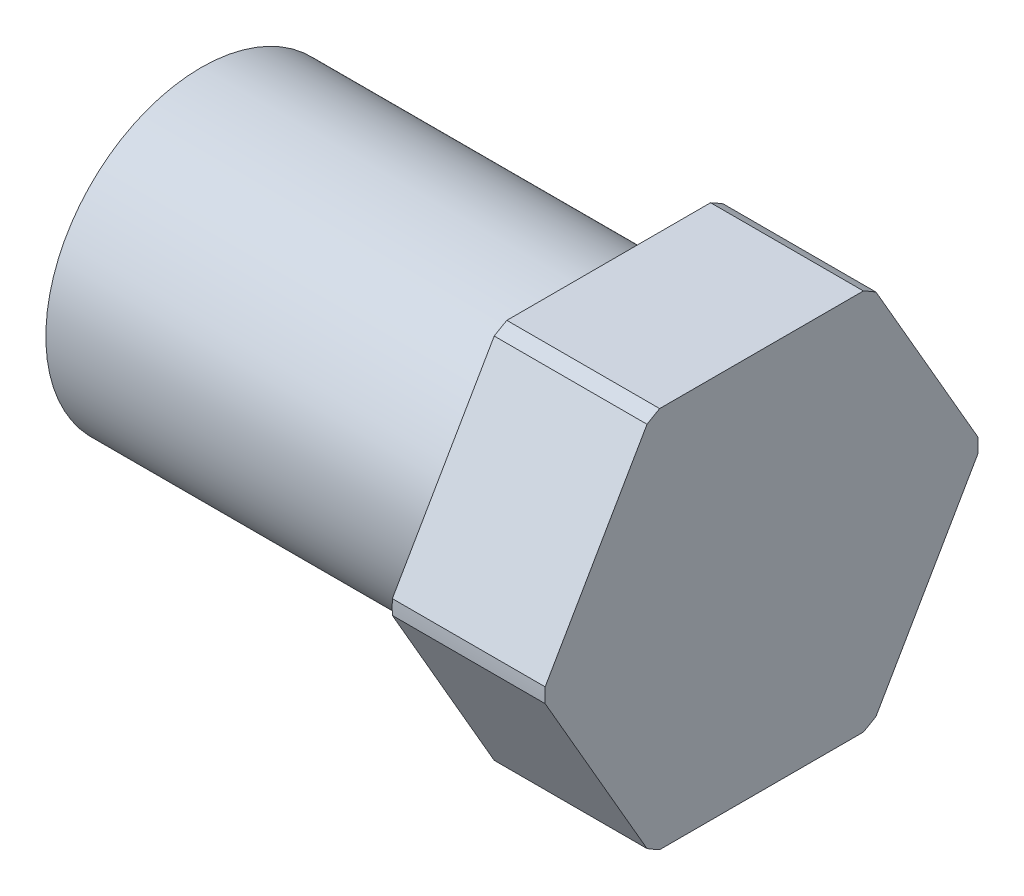
ISO-10303-21;
HEADER;
FILE_DESCRIPTION(('STEP AP214'),'2;1');
FILE_NAME('part.step','',(''),(''),'','','');
FILE_SCHEMA(('AUTOMOTIVE_DESIGN { 1 0 10303 214 1 1 1 1 }'));
ENDSEC;
DATA;
#1=APPLICATION_CONTEXT('core data for automotive mechanical design processes');
#2=APPLICATION_PROTOCOL_DEFINITION('international standard','automotive_design',2000,#1);
#3=PRODUCT_CONTEXT('',#1,'mechanical');
#4=PRODUCT('Part','Part','',(#3));
#5=PRODUCT_RELATED_PRODUCT_CATEGORY('part','',(#4));
#6=PRODUCT_DEFINITION_FORMATION('','',#4);
#7=PRODUCT_DEFINITION_CONTEXT('part definition',#1,'design');
#8=PRODUCT_DEFINITION('design','',#6,#7);
#9=PRODUCT_DEFINITION_SHAPE('','',#8);
#10=(LENGTH_UNIT() NAMED_UNIT(*) SI_UNIT(.MILLI.,.METRE.));
#11=(NAMED_UNIT(*) PLANE_ANGLE_UNIT() SI_UNIT($,.RADIAN.));
#12=(NAMED_UNIT(*) SI_UNIT($,.STERADIAN.) SOLID_ANGLE_UNIT());
#13=UNCERTAINTY_MEASURE_WITH_UNIT(LENGTH_MEASURE(1.E-05),#10,'distance_accuracy_value','');
#14=(GEOMETRIC_REPRESENTATION_CONTEXT(3) GLOBAL_UNCERTAINTY_ASSIGNED_CONTEXT((#13)) GLOBAL_UNIT_ASSIGNED_CONTEXT((#10,
#11,#12)) REPRESENTATION_CONTEXT('',''));
#15=CARTESIAN_POINT('',(0.,0.,0.));
#16=DIRECTION('',(0.,0.,1.));
#17=DIRECTION('',(1.,0.,0.));
#18=AXIS2_PLACEMENT_3D('',#15,#16,#17);
#19=CARTESIAN_POINT('',(0.,5.55625,0.));
#20=DIRECTION('',(-1.,0.,0.));
#21=DIRECTION('',(0.,-1.,0.));
#22=AXIS2_PLACEMENT_3D('',#19,#20,#21);
#23=PLANE('',#22);
#24=DIRECTION('',(0.,0.,-1.));
#25=VECTOR('',#24,1.);
#26=CARTESIAN_POINT('',(0.,9.525,0.));
#27=LINE('',#26,#25);
#28=CARTESIAN_POINT('',(0.,9.525,5.07999999999999));
#29=VERTEX_POINT('',#28);
#30=CARTESIAN_POINT('',(0.,9.525,-5.07999999999999));
#31=VERTEX_POINT('',#30);
#32=EDGE_CURVE('E214',#29,#31,#27,.T.);
#33=ORIENTED_EDGE('',*,*,#32,.F.);
#34=CARTESIAN_POINT('',(0.,0.,0.));
#35=DIRECTION('',(-1.,0.,0.));
#36=DIRECTION('',(0.,-1.,0.));
#37=AXIS2_PLACEMENT_3D('',#34,#35,#36);
#38=CIRCLE('',#37,10.795);
#39=CARTESIAN_POINT('',(0.,9.16190905122495,5.70889197104678));
#40=VERTEX_POINT('',#39);
#41=EDGE_CURVE('E250',#40,#29,#38,.T.);
#42=ORIENTED_EDGE('',*,*,#41,.F.);
#43=DIRECTION('',(0.,0.866025403784439,-0.5));
#44=VECTOR('',#43,1.);
#45=CARTESIAN_POINT('',(0.,8.9296875,5.84296514615814));
#46=LINE('',#45,#44);
#47=CARTESIAN_POINT('',(0.,0.363090948775056,10.7888919710468));
#48=VERTEX_POINT('',#47);
#49=EDGE_CURVE('E208',#48,#40,#46,.T.);
#50=ORIENTED_EDGE('',*,*,#49,.F.);
#51=CARTESIAN_POINT('',(0.,-0.363090948775054,10.7888919710468));
#52=VERTEX_POINT('',#51);
#53=EDGE_CURVE('E162',#52,#48,#38,.T.);
#54=ORIENTED_EDGE('',*,*,#53,.F.);
#55=DIRECTION('',(0.,0.866025403784439,0.5));
#56=VECTOR('',#55,1.);
#57=CARTESIAN_POINT('',(0.,-0.595312500000007,10.6548187959354));
#58=LINE('',#57,#56);
#59=CARTESIAN_POINT('',(0.,-9.16190905122495,5.70889197104677));
#60=VERTEX_POINT('',#59);
#61=EDGE_CURVE('E184',#60,#52,#58,.T.);
#62=ORIENTED_EDGE('',*,*,#61,.F.);
#63=CARTESIAN_POINT('',(0.,-9.525,5.08));
#64=VERTEX_POINT('',#63);
#65=EDGE_CURVE('E135',#64,#60,#38,.T.);
#66=ORIENTED_EDGE('',*,*,#65,.F.);
#67=DIRECTION('',(0.,0.,1.));
#68=VECTOR('',#67,1.);
#69=CARTESIAN_POINT('',(0.,-9.525,0.));
#70=LINE('',#69,#68);
#71=CARTESIAN_POINT('',(0.,-9.525,-5.08));
#72=VERTEX_POINT('',#71);
#73=EDGE_CURVE('E199',#72,#64,#70,.T.);
#74=ORIENTED_EDGE('',*,*,#73,.F.);
#75=CARTESIAN_POINT('',(0.,-9.16190905122495,-5.70889197104678));
#76=VERTEX_POINT('',#75);
#77=EDGE_CURVE('E158',#76,#72,#38,.T.);
#78=ORIENTED_EDGE('',*,*,#77,.F.);
#79=DIRECTION('',(0.,-0.866025403784439,0.5));
#80=VECTOR('',#79,1.);
#81=CARTESIAN_POINT('',(0.,-0.595312500000004,-10.6548187959354));
#82=LINE('',#81,#80);
#83=CARTESIAN_POINT('',(0.,-0.363090948775052,-10.7888919710468));
#84=VERTEX_POINT('',#83);
#85=EDGE_CURVE('E232',#84,#76,#82,.T.);
#86=ORIENTED_EDGE('',*,*,#85,.F.);
#87=CARTESIAN_POINT('',(0.,0.363090948775054,-10.7888919710468));
#88=VERTEX_POINT('',#87);
#89=EDGE_CURVE('E247',#88,#84,#38,.T.);
#90=ORIENTED_EDGE('',*,*,#89,.F.);
#91=DIRECTION('',(0.,-0.866025403784439,-0.5));
#92=VECTOR('',#91,1.);
#93=CARTESIAN_POINT('',(0.,8.9296875,-5.84296514615813));
#94=LINE('',#93,#92);
#95=CARTESIAN_POINT('',(0.,9.16190905122495,-5.70889197104678));
#96=VERTEX_POINT('',#95);
#97=EDGE_CURVE('E239',#96,#88,#94,.T.);
#98=ORIENTED_EDGE('',*,*,#97,.F.);
#99=EDGE_CURVE('E144',#31,#96,#38,.T.);
#100=ORIENTED_EDGE('',*,*,#99,.F.);
#101=EDGE_LOOP('',(#33,#42,#50,#54,#62,#66,#74,#78,#86,#90,#98,#100));
#102=FACE_BOUND('',#101,.T.);
#103=ADVANCED_FACE('F41',(#102),#23,.F.);
#104=CARTESIAN_POINT('',(-27.94,0.,0.));
#105=DIRECTION('',(-1.,0.,0.));
#106=DIRECTION('',(0.,-1.,0.));
#107=AXIS2_PLACEMENT_3D('',#104,#105,#106);
#108=CYLINDRICAL_SURFACE('',#107,10.795);
#109=DIRECTION('',(-1.,0.,0.));
#110=VECTOR('',#109,1.);
#111=CARTESIAN_POINT('',(-27.94,9.525,-5.07999999999999));
#112=LINE('',#111,#110);
#113=CARTESIAN_POINT('',(-7.62,9.525,-5.07999999999999));
#114=VERTEX_POINT('',#113);
#115=EDGE_CURVE('E212',#31,#114,#112,.T.);
#116=ORIENTED_EDGE('',*,*,#115,.F.);
#117=ORIENTED_EDGE('',*,*,#99,.T.);
#118=DIRECTION('',(-1.,0.,0.));
#119=VECTOR('',#118,1.);
#120=CARTESIAN_POINT('',(-27.94,9.16190905122495,-5.70889197104678));
#121=LINE('',#120,#119);
#122=CARTESIAN_POINT('',(-7.62,9.16190905122495,-5.70889197104678));
#123=VERTEX_POINT('',#122);
#124=EDGE_CURVE('E128',#123,#96,#121,.F.);
#125=ORIENTED_EDGE('',*,*,#124,.F.);
#126=CARTESIAN_POINT('',(-7.62,0.,0.));
#127=DIRECTION('',(-1.,0.,0.));
#128=DIRECTION('',(0.,-1.,0.));
#129=AXIS2_PLACEMENT_3D('',#126,#127,#128);
#130=CIRCLE('',#129,10.795);
#131=EDGE_CURVE('E142',#114,#123,#130,.T.);
#132=ORIENTED_EDGE('',*,*,#131,.F.);
#133=EDGE_LOOP('',(#116,#117,#125,#132));
#134=FACE_BOUND('',#133,.T.);
#135=ADVANCED_FACE('F141',(#134),#108,.T.);
#136=DIRECTION('',(-1.,0.,0.));
#137=VECTOR('',#136,1.);
#138=CARTESIAN_POINT('',(-27.94,9.525,5.07999999999999));
#139=LINE('',#138,#137);
#140=CARTESIAN_POINT('',(-7.62,9.525,5.07999999999999));
#141=VERTEX_POINT('',#140);
#142=EDGE_CURVE('E210',#141,#29,#139,.F.);
#143=ORIENTED_EDGE('',*,*,#142,.F.);
#144=CARTESIAN_POINT('',(-7.62,9.16190905122494,5.70889197104678));
#145=VERTEX_POINT('',#144);
#146=EDGE_CURVE('E149',#145,#141,#130,.T.);
#147=ORIENTED_EDGE('',*,*,#146,.F.);
#148=DIRECTION('',(-1.,0.,0.));
#149=VECTOR('',#148,1.);
#150=CARTESIAN_POINT('',(-27.94,9.16190905122495,5.70889197104678));
#151=LINE('',#150,#149);
#152=EDGE_CURVE('E175',#40,#145,#151,.T.);
#153=ORIENTED_EDGE('',*,*,#152,.F.);
#154=ORIENTED_EDGE('',*,*,#41,.T.);
#155=EDGE_LOOP('',(#143,#147,#153,#154));
#156=FACE_BOUND('',#155,.T.);
#157=ADVANCED_FACE('F255',(#156),#108,.T.);
#158=DIRECTION('',(-1.,0.,0.));
#159=VECTOR('',#158,1.);
#160=CARTESIAN_POINT('',(-27.94,0.363090948775056,10.7888919710468));
#161=LINE('',#160,#159);
#162=CARTESIAN_POINT('',(-7.62,0.363090948775059,10.7888919710468));
#163=VERTEX_POINT('',#162);
#164=EDGE_CURVE('E172',#163,#48,#161,.F.);
#165=ORIENTED_EDGE('',*,*,#164,.F.);
#166=CARTESIAN_POINT('',(-7.62,-0.363090948775067,10.7888919710468));
#167=VERTEX_POINT('',#166);
#168=EDGE_CURVE('E152',#167,#163,#130,.T.);
#169=ORIENTED_EDGE('',*,*,#168,.F.);
#170=DIRECTION('',(-1.,0.,0.));
#171=VECTOR('',#170,1.);
#172=CARTESIAN_POINT('',(-27.94,-0.363090948775054,10.7888919710468));
#173=LINE('',#172,#171);
#174=EDGE_CURVE('E194',#52,#167,#173,.T.);
#175=ORIENTED_EDGE('',*,*,#174,.F.);
#176=ORIENTED_EDGE('',*,*,#53,.T.);
#177=EDGE_LOOP('',(#165,#169,#175,#176));
#178=FACE_BOUND('',#177,.T.);
#179=ADVANCED_FACE('F181',(#178),#108,.T.);
#180=DIRECTION('',(-1.,0.,0.));
#181=VECTOR('',#180,1.);
#182=CARTESIAN_POINT('',(-27.94,-9.16190905122495,5.70889197104677));
#183=LINE('',#182,#181);
#184=CARTESIAN_POINT('',(-7.62,-9.16190905122494,5.70889197104679));
#185=VERTEX_POINT('',#184);
#186=EDGE_CURVE('E192',#185,#60,#183,.F.);
#187=ORIENTED_EDGE('',*,*,#186,.F.);
#188=CARTESIAN_POINT('',(-7.62,-9.525,5.08));
#189=VERTEX_POINT('',#188);
#190=EDGE_CURVE('E154',#189,#185,#130,.T.);
#191=ORIENTED_EDGE('',*,*,#190,.F.);
#192=DIRECTION('',(-1.,0.,0.));
#193=VECTOR('',#192,1.);
#194=CARTESIAN_POINT('',(-27.94,-9.525,5.08));
#195=LINE('',#194,#193);
#196=EDGE_CURVE('E202',#64,#189,#195,.T.);
#197=ORIENTED_EDGE('',*,*,#196,.F.);
#198=ORIENTED_EDGE('',*,*,#65,.T.);
#199=EDGE_LOOP('',(#187,#191,#197,#198));
#200=FACE_BOUND('',#199,.T.);
#201=ADVANCED_FACE('F196',(#200),#108,.T.);
#202=DIRECTION('',(-1.,0.,0.));
#203=VECTOR('',#202,1.);
#204=CARTESIAN_POINT('',(-27.94,-9.525,-5.08));
#205=LINE('',#204,#203);
#206=CARTESIAN_POINT('',(-7.62,-9.525,-5.08));
#207=VERTEX_POINT('',#206);
#208=EDGE_CURVE('E229',#207,#72,#205,.F.);
#209=ORIENTED_EDGE('',*,*,#208,.F.);
#210=CARTESIAN_POINT('',(-7.62,-9.16190905122495,-5.70889197104677));
#211=VERTEX_POINT('',#210);
#212=EDGE_CURVE('E153',#211,#207,#130,.T.);
#213=ORIENTED_EDGE('',*,*,#212,.F.);
#214=DIRECTION('',(-1.,0.,0.));
#215=VECTOR('',#214,1.);
#216=CARTESIAN_POINT('',(-27.94,-9.16190905122495,-5.70889197104678));
#217=LINE('',#216,#215);
#218=EDGE_CURVE('E55',#76,#211,#217,.T.);
#219=ORIENTED_EDGE('',*,*,#218,.F.);
#220=ORIENTED_EDGE('',*,*,#77,.T.);
#221=EDGE_LOOP('',(#209,#213,#219,#220));
#222=FACE_BOUND('',#221,.T.);
#223=ADVANCED_FACE('F226',(#222),#108,.T.);
#224=DIRECTION('',(-1.,0.,0.));
#225=VECTOR('',#224,1.);
#226=CARTESIAN_POINT('',(-27.94,-0.363090948775052,-10.7888919710468));
#227=LINE('',#226,#225);
#228=CARTESIAN_POINT('',(-7.62,-0.363090948775047,-10.7888919710468));
#229=VERTEX_POINT('',#228);
#230=EDGE_CURVE('E237',#229,#84,#227,.F.);
#231=ORIENTED_EDGE('',*,*,#230,.F.);
#232=CARTESIAN_POINT('',(-7.62,0.363090948775062,-10.7888919710468));
#233=VERTEX_POINT('',#232);
#234=EDGE_CURVE('E150',#233,#229,#130,.T.);
#235=ORIENTED_EDGE('',*,*,#234,.F.);
#236=DIRECTION('',(-1.,0.,0.));
#237=VECTOR('',#236,1.);
#238=CARTESIAN_POINT('',(-27.94,0.363090948775054,-10.7888919710468));
#239=LINE('',#238,#237);
#240=EDGE_CURVE('E63',#88,#233,#239,.T.);
#241=ORIENTED_EDGE('',*,*,#240,.F.);
#242=ORIENTED_EDGE('',*,*,#89,.T.);
#243=EDGE_LOOP('',(#231,#235,#241,#242));
#244=FACE_BOUND('',#243,.T.);
#245=ADVANCED_FACE('F246',(#244),#108,.T.);
#246=CARTESIAN_POINT('',(-7.62,10.795,0.));
#247=DIRECTION('',(1.,0.,0.));
#248=DIRECTION('',(0.,1.,0.));
#249=AXIS2_PLACEMENT_3D('',#246,#247,#248);
#250=PLANE('',#249);
#251=CARTESIAN_POINT('',(-7.62,0.,0.));
#252=DIRECTION('',(-1.,0.,0.));
#253=DIRECTION('',(0.,-1.,0.));
#254=AXIS2_PLACEMENT_3D('',#251,#252,#253);
#255=CIRCLE('',#254,7.747);
#256=CARTESIAN_POINT('',(-7.62,-7.747,0.));
#257=VERTEX_POINT('',#256);
#258=EDGE_CURVE('E159',#257,#257,#255,.T.);
#259=ORIENTED_EDGE('',*,*,#258,.F.);
#260=EDGE_LOOP('',(#259));
#261=FACE_BOUND('',#260,.T.);
#262=DIRECTION('',(0.,0.,1.));
#263=VECTOR('',#262,1.);
#264=CARTESIAN_POINT('',(-7.62,9.525,0.));
#265=LINE('',#264,#263);
#266=EDGE_CURVE('E12',#114,#141,#265,.T.);
#267=ORIENTED_EDGE('',*,*,#266,.F.);
#268=ORIENTED_EDGE('',*,*,#131,.T.);
#269=DIRECTION('',(0.,0.866025403784439,0.5));
#270=VECTOR('',#269,1.);
#271=CARTESIAN_POINT('',(-7.62,12.85875,-3.57451985412027));
#272=LINE('',#271,#270);
#273=EDGE_CURVE('E125',#233,#123,#272,.T.);
#274=ORIENTED_EDGE('',*,*,#273,.F.);
#275=ORIENTED_EDGE('',*,*,#234,.T.);
#276=DIRECTION('',(0.,0.866025403784439,-0.5));
#277=VECTOR('',#276,1.);
#278=CARTESIAN_POINT('',(-7.62,3.33375,-12.9232640879733));
#279=LINE('',#278,#277);
#280=EDGE_CURVE('E134',#211,#229,#279,.T.);
#281=ORIENTED_EDGE('',*,*,#280,.F.);
#282=ORIENTED_EDGE('',*,*,#212,.T.);
#283=DIRECTION('',(0.,0.,-1.));
#284=VECTOR('',#283,1.);
#285=CARTESIAN_POINT('',(-7.62,-9.525,0.));
#286=LINE('',#285,#284);
#287=EDGE_CURVE('E165',#189,#207,#286,.T.);
#288=ORIENTED_EDGE('',*,*,#287,.F.);
#289=ORIENTED_EDGE('',*,*,#190,.T.);
#290=DIRECTION('',(0.,-0.866025403784439,-0.5));
#291=VECTOR('',#290,1.);
#292=CARTESIAN_POINT('',(-7.62,3.33374999999999,12.9232640879733));
#293=LINE('',#292,#291);
#294=EDGE_CURVE('E167',#167,#185,#293,.T.);
#295=ORIENTED_EDGE('',*,*,#294,.F.);
#296=ORIENTED_EDGE('',*,*,#168,.T.);
#297=DIRECTION('',(0.,-0.866025403784439,0.5));
#298=VECTOR('',#297,1.);
#299=CARTESIAN_POINT('',(-7.62,12.85875,3.57451985412027));
#300=LINE('',#299,#298);
#301=EDGE_CURVE('E48',#145,#163,#300,.T.);
#302=ORIENTED_EDGE('',*,*,#301,.F.);
#303=ORIENTED_EDGE('',*,*,#146,.T.);
#304=EDGE_LOOP('',(#267,#268,#274,#275,#281,#282,#288,#289,#295,#296,#302,#303));
#305=FACE_BOUND('',#304,.T.);
#306=ADVANCED_FACE('F147',(#261,#305),#250,.F.);
#307=CARTESIAN_POINT('',(-27.94,0.,0.));
#308=DIRECTION('',(-1.,0.,0.));
#309=DIRECTION('',(0.,-1.,0.));
#310=AXIS2_PLACEMENT_3D('',#307,#308,#309);
#311=CYLINDRICAL_SURFACE('',#310,7.747);
#312=CARTESIAN_POINT('',(-27.94,0.,0.));
#313=DIRECTION('',(-1.,0.,0.));
#314=DIRECTION('',(0.,-1.,0.));
#315=AXIS2_PLACEMENT_3D('',#312,#313,#314);
#316=CIRCLE('',#315,7.747);
#317=CARTESIAN_POINT('',(-27.94,-7.747,0.));
#318=VERTEX_POINT('',#317);
#319=EDGE_CURVE('E215',#318,#318,#316,.T.);
#320=ORIENTED_EDGE('',*,*,#319,.F.);
#321=EDGE_LOOP('',(#320));
#322=FACE_BOUND('',#321,.T.);
#323=ORIENTED_EDGE('',*,*,#258,.T.);
#324=EDGE_LOOP('',(#323));
#325=FACE_BOUND('',#324,.T.);
#326=ADVANCED_FACE('F279',(#322,#325),#311,.T.);
#327=CARTESIAN_POINT('',(-27.94,7.747,0.));
#328=DIRECTION('',(1.,0.,0.));
#329=DIRECTION('',(0.,1.,0.));
#330=AXIS2_PLACEMENT_3D('',#327,#328,#329);
#331=PLANE('',#330);
#332=ORIENTED_EDGE('',*,*,#319,.T.);
#333=EDGE_LOOP('',(#332));
#334=FACE_BOUND('',#333,.T.);
#335=ADVANCED_FACE('F306',(#334),#331,.F.);
#336=CARTESIAN_POINT('',(19.05,9.525,-5.49926131403118));
#337=DIRECTION('',(0.,0.5,-0.866025403784438));
#338=DIRECTION('',(0.,0.866025403784439,0.5));
#339=AXIS2_PLACEMENT_3D('',#336,#337,#338);
#340=PLANE('',#339);
#341=ORIENTED_EDGE('',*,*,#97,.T.);
#342=ORIENTED_EDGE('',*,*,#240,.T.);
#343=ORIENTED_EDGE('',*,*,#273,.T.);
#344=ORIENTED_EDGE('',*,*,#124,.T.);
#345=EDGE_LOOP('',(#341,#342,#343,#344));
#346=FACE_BOUND('',#345,.T.);
#347=ADVANCED_FACE('F127',(#346),#340,.T.);
#348=CARTESIAN_POINT('',(19.05,0.,-10.9985226280624));
#349=DIRECTION('',(0.,-0.5,-0.866025403784439));
#350=DIRECTION('',(0.,0.866025403784439,-0.5));
#351=AXIS2_PLACEMENT_3D('',#348,#349,#350);
#352=PLANE('',#351);
#353=ORIENTED_EDGE('',*,*,#85,.T.);
#354=ORIENTED_EDGE('',*,*,#218,.T.);
#355=ORIENTED_EDGE('',*,*,#280,.T.);
#356=ORIENTED_EDGE('',*,*,#230,.T.);
#357=EDGE_LOOP('',(#353,#354,#355,#356));
#358=FACE_BOUND('',#357,.T.);
#359=ADVANCED_FACE('F339',(#358),#352,.T.);
#360=CARTESIAN_POINT('',(19.05,-9.525,-5.49926131403118));
#361=DIRECTION('',(0.,-1.,0.));
#362=DIRECTION('',(1.,0.,0.));
#363=AXIS2_PLACEMENT_3D('',#360,#361,#362);
#364=PLANE('',#363);
#365=ORIENTED_EDGE('',*,*,#73,.T.);
#366=ORIENTED_EDGE('',*,*,#196,.T.);
#367=ORIENTED_EDGE('',*,*,#287,.T.);
#368=ORIENTED_EDGE('',*,*,#208,.T.);
#369=EDGE_LOOP('',(#365,#366,#367,#368));
#370=FACE_BOUND('',#369,.T.);
#371=ADVANCED_FACE('F347',(#370),#364,.T.);
#372=CARTESIAN_POINT('',(19.05,-9.525,5.49926131403119));
#373=DIRECTION('',(0.,-0.5,0.866025403784438));
#374=DIRECTION('',(0.,-0.866025403784439,-0.5));
#375=AXIS2_PLACEMENT_3D('',#372,#373,#374);
#376=PLANE('',#375);
#377=ORIENTED_EDGE('',*,*,#61,.T.);
#378=ORIENTED_EDGE('',*,*,#174,.T.);
#379=ORIENTED_EDGE('',*,*,#294,.T.);
#380=ORIENTED_EDGE('',*,*,#186,.T.);
#381=EDGE_LOOP('',(#377,#378,#379,#380));
#382=FACE_BOUND('',#381,.T.);
#383=ADVANCED_FACE('F191',(#382),#376,.T.);
#384=CARTESIAN_POINT('',(19.05,0.,10.9985226280624));
#385=DIRECTION('',(0.,0.5,0.866025403784439));
#386=DIRECTION('',(0.,-0.866025403784439,0.5));
#387=AXIS2_PLACEMENT_3D('',#384,#385,#386);
#388=PLANE('',#387);
#389=ORIENTED_EDGE('',*,*,#49,.T.);
#390=ORIENTED_EDGE('',*,*,#152,.T.);
#391=ORIENTED_EDGE('',*,*,#301,.T.);
#392=ORIENTED_EDGE('',*,*,#164,.T.);
#393=EDGE_LOOP('',(#389,#390,#391,#392));
#394=FACE_BOUND('',#393,.T.);
#395=ADVANCED_FACE('F171',(#394),#388,.T.);
#396=CARTESIAN_POINT('',(19.05,9.525,5.49926131403118));
#397=DIRECTION('',(0.,1.,0.));
#398=DIRECTION('',(0.,0.,1.));
#399=AXIS2_PLACEMENT_3D('',#396,#397,#398);
#400=PLANE('',#399);
#401=ORIENTED_EDGE('',*,*,#32,.T.);
#402=ORIENTED_EDGE('',*,*,#115,.T.);
#403=ORIENTED_EDGE('',*,*,#266,.T.);
#404=ORIENTED_EDGE('',*,*,#142,.T.);
#405=EDGE_LOOP('',(#401,#402,#403,#404));
#406=FACE_BOUND('',#405,.T.);
#407=ADVANCED_FACE('F257',(#406),#400,.T.);
#408=CLOSED_SHELL('',(#103,#135,#157,#179,#201,#223,#245,#306,#326,#335,#347,#359,#371,#383,
#395,#407));
#409=MANIFOLD_SOLID_BREP('B2',#408);
#410=ADVANCED_BREP_SHAPE_REPRESENTATION('',(#18,#409),#14);
#411=SHAPE_DEFINITION_REPRESENTATION(#9,#410);
ENDSEC;
END-ISO-10303-21;
